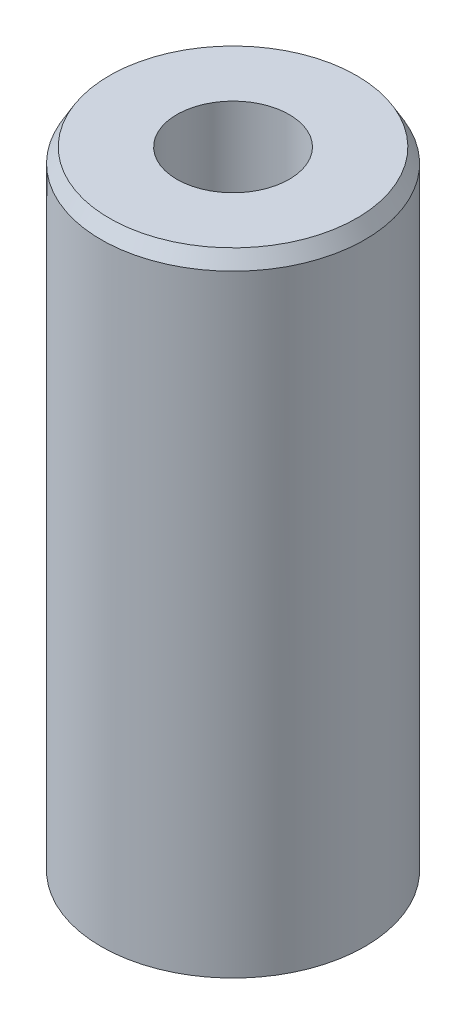
ISO-10303-21;
HEADER;
FILE_DESCRIPTION(('STEP AP214'),'2;1');
FILE_NAME('part.step','',(''),(''),'','','');
FILE_SCHEMA(('AUTOMOTIVE_DESIGN { 1 0 10303 214 1 1 1 1 }'));
ENDSEC;
DATA;
#1=APPLICATION_CONTEXT('core data for automotive mechanical design processes');
#2=APPLICATION_PROTOCOL_DEFINITION('international standard','automotive_design',2000,#1);
#3=PRODUCT_CONTEXT('',#1,'mechanical');
#4=PRODUCT('Part','Part','',(#3));
#5=PRODUCT_RELATED_PRODUCT_CATEGORY('part','',(#4));
#6=PRODUCT_DEFINITION_FORMATION('','',#4);
#7=PRODUCT_DEFINITION_CONTEXT('part definition',#1,'design');
#8=PRODUCT_DEFINITION('design','',#6,#7);
#9=PRODUCT_DEFINITION_SHAPE('','',#8);
#10=(LENGTH_UNIT() NAMED_UNIT(*) SI_UNIT(.MILLI.,.METRE.));
#11=(NAMED_UNIT(*) PLANE_ANGLE_UNIT() SI_UNIT($,.RADIAN.));
#12=(NAMED_UNIT(*) SI_UNIT($,.STERADIAN.) SOLID_ANGLE_UNIT());
#13=UNCERTAINTY_MEASURE_WITH_UNIT(LENGTH_MEASURE(1.E-05),#10,'distance_accuracy_value','');
#14=(GEOMETRIC_REPRESENTATION_CONTEXT(3) GLOBAL_UNCERTAINTY_ASSIGNED_CONTEXT((#13)) GLOBAL_UNIT_ASSIGNED_CONTEXT((#10,
#11,#12)) REPRESENTATION_CONTEXT('',''));
#15=CARTESIAN_POINT('',(0.,0.,0.));
#16=DIRECTION('',(0.,0.,1.));
#17=DIRECTION('',(1.,0.,0.));
#18=AXIS2_PLACEMENT_3D('',#15,#16,#17);
#19=CARTESIAN_POINT('',(0.,240.612343965971,0.));
#20=DIRECTION('',(0.,-1.,0.));
#21=DIRECTION('',(0.,0.,-1.));
#22=AXIS2_PLACEMENT_3D('',#19,#20,#21);
#23=CYLINDRICAL_SURFACE('',#22,50.);
#24=CARTESIAN_POINT('',(0.,235.162275658452,0.));
#25=DIRECTION('',(0.,1.,0.));
#26=DIRECTION('',(0.,0.,1.));
#27=AXIS2_PLACEMENT_3D('',#24,#25,#26);
#28=CIRCLE('',#27,50.);
#29=CARTESIAN_POINT('',(0.,235.162275658452,-50.));
#30=VERTEX_POINT('',#29);
#31=EDGE_CURVE('E50',#30,#30,#28,.F.);
#32=ORIENTED_EDGE('',*,*,#31,.T.);
#33=EDGE_LOOP('',(#32));
#34=FACE_BOUND('',#33,.T.);
#35=CARTESIAN_POINT('',(0.,3.14659840444809,0.));
#36=DIRECTION('',(0.,1.,0.));
#37=DIRECTION('',(0.,0.,1.));
#38=AXIS2_PLACEMENT_3D('',#35,#36,#37);
#39=CIRCLE('',#38,50.);
#40=CARTESIAN_POINT('',(0.,3.14659840444809,50.));
#41=VERTEX_POINT('',#40);
#42=EDGE_CURVE('E51',#41,#41,#39,.T.);
#43=ORIENTED_EDGE('',*,*,#42,.T.);
#44=EDGE_LOOP('',(#43));
#45=FACE_BOUND('',#44,.T.);
#46=ADVANCED_FACE('F39',(#34,#45),#23,.T.);
#47=CARTESIAN_POINT('',(0.,240.612343965971,0.));
#48=DIRECTION('',(0.,1.,0.));
#49=DIRECTION('',(0.,0.,1.));
#50=AXIS2_PLACEMENT_3D('',#47,#48,#49);
#51=PLANE('',#50);
#52=CARTESIAN_POINT('',(0.,240.612343965971,0.));
#53=DIRECTION('',(0.,1.,0.));
#54=DIRECTION('',(0.,0.,1.));
#55=AXIS2_PLACEMENT_3D('',#52,#53,#54);
#56=CIRCLE('',#55,46.8534015955519);
#57=CARTESIAN_POINT('',(0.,240.612343965971,-46.8534015955519));
#58=VERTEX_POINT('',#57);
#59=EDGE_CURVE('E54',#58,#58,#56,.T.);
#60=ORIENTED_EDGE('',*,*,#59,.T.);
#61=EDGE_LOOP('',(#60));
#62=FACE_BOUND('',#61,.T.);
#63=CARTESIAN_POINT('',(0.,240.612343965971,0.));
#64=DIRECTION('',(0.,1.,0.));
#65=DIRECTION('',(0.,0.,1.));
#66=AXIS2_PLACEMENT_3D('',#63,#64,#65);
#67=CIRCLE('',#66,21.2913234992533);
#68=CARTESIAN_POINT('',(0.,240.612343965971,21.2913234992533));
#69=VERTEX_POINT('',#68);
#70=EDGE_CURVE('E58',#69,#69,#67,.T.);
#71=ORIENTED_EDGE('',*,*,#70,.F.);
#72=EDGE_LOOP('',(#71));
#73=FACE_BOUND('',#72,.T.);
#74=ADVANCED_FACE('F69',(#62,#73),#51,.T.);
#75=CARTESIAN_POINT('',(0.,0.,0.));
#76=DIRECTION('',(0.,1.,0.));
#77=DIRECTION('',(0.,0.,1.));
#78=AXIS2_PLACEMENT_3D('',#75,#76,#77);
#79=PLANE('',#78);
#80=CARTESIAN_POINT('',(0.,0.,0.));
#81=DIRECTION('',(0.,1.,0.));
#82=DIRECTION('',(0.,0.,1.));
#83=AXIS2_PLACEMENT_3D('',#80,#81,#82);
#84=CIRCLE('',#83,44.5499316924807);
#85=CARTESIAN_POINT('',(0.,0.,44.5499316924807));
#86=VERTEX_POINT('',#85);
#87=EDGE_CURVE('E10',#86,#86,#84,.F.);
#88=ORIENTED_EDGE('',*,*,#87,.T.);
#89=EDGE_LOOP('',(#88));
#90=FACE_BOUND('',#89,.T.);
#91=CARTESIAN_POINT('',(0.,0.,0.));
#92=DIRECTION('',(0.,1.,0.));
#93=DIRECTION('',(0.,0.,1.));
#94=AXIS2_PLACEMENT_3D('',#91,#92,#93);
#95=CIRCLE('',#94,21.2913234992533);
#96=CARTESIAN_POINT('',(0.,0.,21.2913234992533));
#97=VERTEX_POINT('',#96);
#98=EDGE_CURVE('E63',#97,#97,#95,.T.);
#99=ORIENTED_EDGE('',*,*,#98,.T.);
#100=EDGE_LOOP('',(#99));
#101=FACE_BOUND('',#100,.T.);
#102=ADVANCED_FACE('F75',(#90,#101),#79,.F.);
#103=CARTESIAN_POINT('',(0.,240.612343965971,0.));
#104=DIRECTION('',(0.,-1.,0.));
#105=DIRECTION('',(0.,0.,-1.));
#106=AXIS2_PLACEMENT_3D('',#103,#104,#105);
#107=CYLINDRICAL_SURFACE('',#106,21.2913234992533);
#108=ORIENTED_EDGE('',*,*,#70,.T.);
#109=EDGE_LOOP('',(#108));
#110=FACE_BOUND('',#109,.T.);
#111=ORIENTED_EDGE('',*,*,#98,.F.);
#112=EDGE_LOOP('',(#111));
#113=FACE_BOUND('',#112,.T.);
#114=ADVANCED_FACE('F70',(#110,#113),#107,.F.);
#115=CARTESIAN_POINT('',(0.,240.612343965971,0.));
#116=DIRECTION('',(0.,-1.,0.));
#117=DIRECTION('',(0.,0.,-1.));
#118=AXIS2_PLACEMENT_3D('',#115,#116,#117);
#119=CONICAL_SURFACE('',#118,46.8534015955519,0.523598775598291);
#120=CARTESIAN_POINT('',(0.,235.162275658452,-50.));
#121=CARTESIAN_POINT('',(0.,235.219047203322,-49.967222933287));
#122=CARTESIAN_POINT('',(0.,235.275818748192,-49.934445866574));
#123=CARTESIAN_POINT('',(0.,235.389361837932,-49.868891733148));
#124=CARTESIAN_POINT('',(0.,235.446133382802,-49.836114666435));
#125=CARTESIAN_POINT('',(0.,235.559676472542,-49.770560533009));
#126=CARTESIAN_POINT('',(0.,235.616448017412,-49.737783466296));
#127=CARTESIAN_POINT('',(0.,235.729991107152,-49.67222933287));
#128=CARTESIAN_POINT('',(0.,235.786762652022,-49.639452266157));
#129=CARTESIAN_POINT('',(0.,235.900305741762,-49.573898132731));
#130=CARTESIAN_POINT('',(0.,235.957077286632,-49.541121066018));
#131=CARTESIAN_POINT('',(0.,236.070620376372,-49.475566932592));
#132=CARTESIAN_POINT('',(0.,236.127391921242,-49.442789865879));
#133=CARTESIAN_POINT('',(0.,236.240935010982,-49.377235732453));
#134=CARTESIAN_POINT('',(0.,236.297706555852,-49.34445866574));
#135=CARTESIAN_POINT('',(0.,236.411249645592,-49.278904532314));
#136=CARTESIAN_POINT('',(0.,236.468021190462,-49.246127465601));
#137=CARTESIAN_POINT('',(0.,236.581564280202,-49.180573332175));
#138=CARTESIAN_POINT('',(0.,236.638335825072,-49.147796265462));
#139=CARTESIAN_POINT('',(0.,236.751878914812,-49.082242132036));
#140=CARTESIAN_POINT('',(0.,236.808650459682,-49.049465065323));
#141=CARTESIAN_POINT('',(0.,236.922193549422,-48.983910931897));
#142=CARTESIAN_POINT('',(0.,236.978965094292,-48.951133865184));
#143=CARTESIAN_POINT('',(0.,237.092508184032,-48.885579731758));
#144=CARTESIAN_POINT('',(0.,237.149279728902,-48.852802665045));
#145=CARTESIAN_POINT('',(0.,237.262822818642,-48.787248531619));
#146=CARTESIAN_POINT('',(0.,237.319594363512,-48.754471464906));
#147=CARTESIAN_POINT('',(0.,237.433137453252,-48.68891733148));
#148=CARTESIAN_POINT('',(0.,237.489908998122,-48.656140264767));
#149=CARTESIAN_POINT('',(0.,237.603452087862,-48.590586131341));
#150=CARTESIAN_POINT('',(0.,237.660223632732,-48.557809064628));
#151=CARTESIAN_POINT('',(0.,237.773766722472,-48.492254931202));
#152=CARTESIAN_POINT('',(0.,237.830538267342,-48.459477864489));
#153=CARTESIAN_POINT('',(0.,237.944081357082,-48.393923731063));
#154=CARTESIAN_POINT('',(0.,238.000852901952,-48.36114666435));
#155=CARTESIAN_POINT('',(0.,238.114395991691,-48.295592530924));
#156=CARTESIAN_POINT('',(0.,238.171167536561,-48.262815464211));
#157=CARTESIAN_POINT('',(0.,238.284710626301,-48.197261330785));
#158=CARTESIAN_POINT('',(0.,238.341482171171,-48.164484264072));
#159=CARTESIAN_POINT('',(0.,238.455025260911,-48.098930130646));
#160=CARTESIAN_POINT('',(0.,238.511796805781,-48.066153063933));
#161=CARTESIAN_POINT('',(0.,238.625339895521,-48.000598930507));
#162=CARTESIAN_POINT('',(0.,238.682111440391,-47.967821863794));
#163=CARTESIAN_POINT('',(0.,238.795654530131,-47.902267730368));
#164=CARTESIAN_POINT('',(0.,238.852426075001,-47.869490663655));
#165=CARTESIAN_POINT('',(0.,238.965969164741,-47.803936530229));
#166=CARTESIAN_POINT('',(0.,239.022740709611,-47.771159463516));
#167=CARTESIAN_POINT('',(0.,239.136283799351,-47.70560533009));
#168=CARTESIAN_POINT('',(0.,239.193055344221,-47.672828263377));
#169=CARTESIAN_POINT('',(0.,239.306598433961,-47.607274129951));
#170=CARTESIAN_POINT('',(0.,239.363369978831,-47.574497063238));
#171=CARTESIAN_POINT('',(0.,239.476913068571,-47.508942929812));
#172=CARTESIAN_POINT('',(0.,239.533684613441,-47.476165863099));
#173=CARTESIAN_POINT('',(0.,239.647227703181,-47.410611729673));
#174=CARTESIAN_POINT('',(0.,239.703999248051,-47.3778346629599));
#175=CARTESIAN_POINT('',(0.,239.817542337791,-47.312280529534));
#176=CARTESIAN_POINT('',(0.,239.874313882661,-47.2795034628209));
#177=CARTESIAN_POINT('',(0.,239.987856972401,-47.2139493293949));
#178=CARTESIAN_POINT('',(0.,240.044628517271,-47.1811722626819));
#179=CARTESIAN_POINT('',(0.,240.158171607011,-47.1156181292559));
#180=CARTESIAN_POINT('',(0.,240.214943151881,-47.0828410625429));
#181=CARTESIAN_POINT('',(0.,240.328486241621,-47.0172869291169));
#182=CARTESIAN_POINT('',(0.,240.385257786491,-46.9845098624039));
#183=CARTESIAN_POINT('',(0.,240.498800876231,-46.9189557289779));
#184=CARTESIAN_POINT('',(0.,240.555572421101,-46.8861786622649));
#185=CARTESIAN_POINT('',(0.,240.612343965971,-46.8534015955519));
#186=B_SPLINE_CURVE_WITH_KNOTS('',3,(#120,#121,#122,#123,#124,#125,#126,#127,#128,#129,#130,
#131,#132,#133,#134,#135,#136,#137,#138,#139,#140,#141,#142,#143,#144,#145,#146,#147,#148,#149,
#150,#151,#152,#153,#154,#155,#156,#157,#158,#159,#160,#161,#162,#163,#164,#165,#166,#167,#168,
#169,#170,#171,#172,#173,#174,#175,#176,#177,#178,#179,#180,#181,#182,#183,#184,#185),
.UNSPECIFIED.,.F.,.F.,(4,2,2,2,2,2,2,2,2,2,2,2,2,2,2,2,2,2,2,2,2,2,2,2,2,2,2,2,2,2,2,2,4),(0.,
0.196662400278009,0.393324800556018,0.589987200834026,0.786649601112032,0.98331200139004,
1.17997440166805,1.37663680194606,1.57329920222407,1.76996160250208,1.96662400278008,
2.16328640305809,2.3599488033361,2.55661120361411,2.75327360389212,2.94993600417013,
3.14659840444811,3.34326080472612,3.53992320500413,3.73658560528214,3.93324800556015,
4.12991040583815,4.32657280611616,4.52323520639417,4.71989760667218,4.91656000695019,
5.1132224072282,5.30988480750621,5.50654720778422,5.70320960806223,5.89987200834023,
6.09653440861824,6.29319680889625),.UNSPECIFIED.);
#187=EDGE_CURVE('BSEAM81',#30,#58,#186,.T.);
#188=ORIENTED_EDGE('',*,*,#31,.F.);
#189=ORIENTED_EDGE('',*,*,#59,.F.);
#190=ORIENTED_EDGE('',*,*,#187,.T.);
#191=ORIENTED_EDGE('',*,*,#187,.F.);
#192=EDGE_LOOP('',(#188,#190,#189,#191));
#193=FACE_BOUND('',#192,.T.);
#194=ADVANCED_FACE('F81',(#193),#119,.T.);
#195=CARTESIAN_POINT('',(0.,3.14659840444809,0.));
#196=DIRECTION('',(0.,1.,0.));
#197=DIRECTION('',(0.,0.,1.));
#198=AXIS2_PLACEMENT_3D('',#195,#196,#197);
#199=CONICAL_SURFACE('',#198,50.,1.0471975511966);
#200=ORIENTED_EDGE('',*,*,#87,.F.);
#201=EDGE_LOOP('',(#200));
#202=FACE_BOUND('',#201,.T.);
#203=ORIENTED_EDGE('',*,*,#42,.F.);
#204=EDGE_LOOP('',(#203));
#205=FACE_BOUND('',#204,.T.);
#206=ADVANCED_FACE('F45',(#202,#205),#199,.T.);
#207=CLOSED_SHELL('',(#46,#74,#102,#114,#194,#206));
#208=MANIFOLD_SOLID_BREP('B2',#207);
#209=ADVANCED_BREP_SHAPE_REPRESENTATION('',(#18,#208),#14);
#210=SHAPE_DEFINITION_REPRESENTATION(#9,#209);
ENDSEC;
END-ISO-10303-21;
